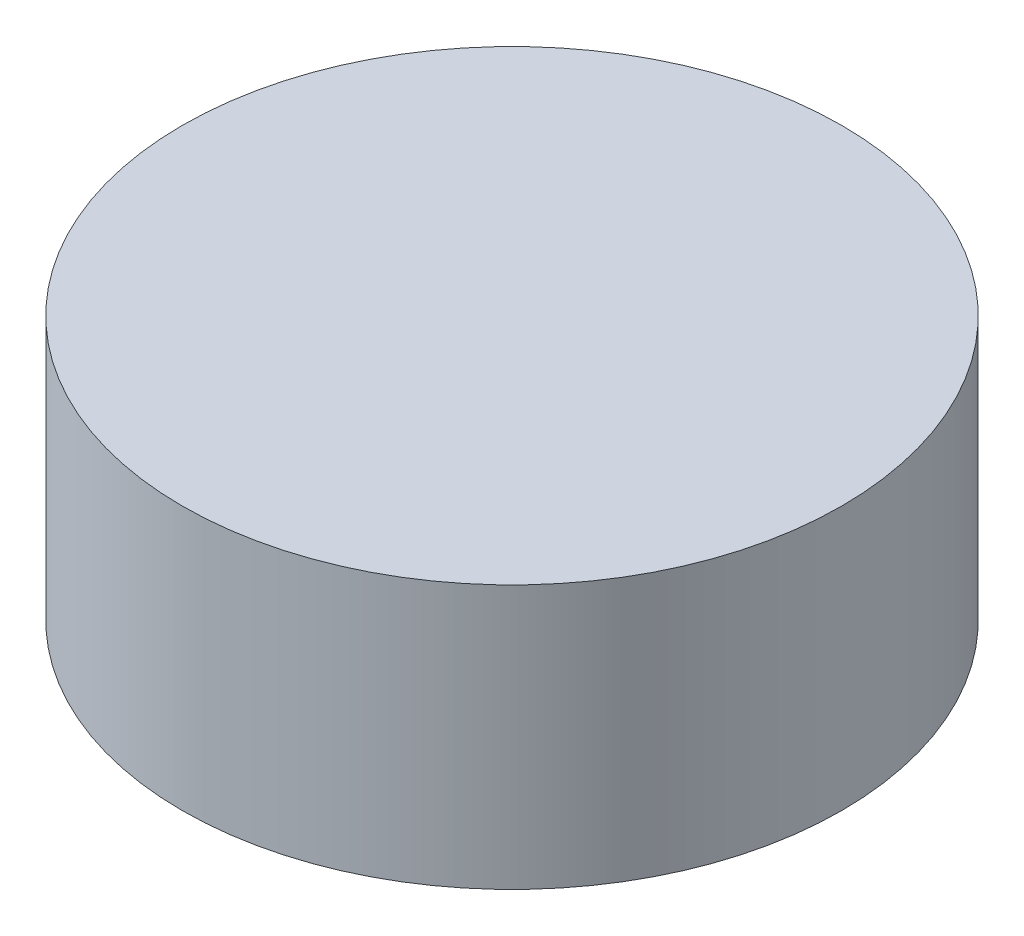
ISO-10303-21;
HEADER;
FILE_DESCRIPTION(('STEP AP214'),'2;1');
FILE_NAME('part.step','',(''),(''),'','','');
FILE_SCHEMA(('AUTOMOTIVE_DESIGN { 1 0 10303 214 1 1 1 1 }'));
ENDSEC;
DATA;
#1=APPLICATION_CONTEXT('core data for automotive mechanical design processes');
#2=APPLICATION_PROTOCOL_DEFINITION('international standard','automotive_design',2000,#1);
#3=PRODUCT_CONTEXT('',#1,'mechanical');
#4=PRODUCT('Part','Part','',(#3));
#5=PRODUCT_RELATED_PRODUCT_CATEGORY('part','',(#4));
#6=PRODUCT_DEFINITION_FORMATION('','',#4);
#7=PRODUCT_DEFINITION_CONTEXT('part definition',#1,'design');
#8=PRODUCT_DEFINITION('design','',#6,#7);
#9=PRODUCT_DEFINITION_SHAPE('','',#8);
#10=(LENGTH_UNIT() NAMED_UNIT(*) SI_UNIT(.MILLI.,.METRE.));
#11=(NAMED_UNIT(*) PLANE_ANGLE_UNIT() SI_UNIT($,.RADIAN.));
#12=(NAMED_UNIT(*) SI_UNIT($,.STERADIAN.) SOLID_ANGLE_UNIT());
#13=UNCERTAINTY_MEASURE_WITH_UNIT(LENGTH_MEASURE(1.E-05),#10,'distance_accuracy_value','');
#14=(GEOMETRIC_REPRESENTATION_CONTEXT(3) GLOBAL_UNCERTAINTY_ASSIGNED_CONTEXT((#13)) GLOBAL_UNIT_ASSIGNED_CONTEXT((#10,
#11,#12)) REPRESENTATION_CONTEXT('',''));
#15=CARTESIAN_POINT('',(0.,0.,0.));
#16=DIRECTION('',(0.,0.,1.));
#17=DIRECTION('',(1.,0.,0.));
#18=AXIS2_PLACEMENT_3D('',#15,#16,#17);
#19=CARTESIAN_POINT('',(0.,2.,0.));
#20=DIRECTION('',(0.,-1.,0.));
#21=DIRECTION('',(0.,0.,-1.));
#22=AXIS2_PLACEMENT_3D('',#19,#20,#21);
#23=CYLINDRICAL_SURFACE('',#22,2.5);
#24=CARTESIAN_POINT('',(0.,2.,0.));
#25=DIRECTION('',(0.,1.,0.));
#26=DIRECTION('',(0.,0.,1.));
#27=AXIS2_PLACEMENT_3D('',#24,#25,#26);
#28=CIRCLE('',#27,2.5);
#29=CARTESIAN_POINT('',(0.,2.,2.5));
#30=VERTEX_POINT('',#29);
#31=EDGE_CURVE('E10',#30,#30,#28,.T.);
#32=ORIENTED_EDGE('',*,*,#31,.F.);
#33=EDGE_LOOP('',(#32));
#34=FACE_BOUND('',#33,.T.);
#35=CARTESIAN_POINT('',(0.,0.,0.));
#36=DIRECTION('',(0.,1.,0.));
#37=DIRECTION('',(0.,0.,1.));
#38=AXIS2_PLACEMENT_3D('',#35,#36,#37);
#39=CIRCLE('',#38,2.5);
#40=CARTESIAN_POINT('',(0.,0.,2.5));
#41=VERTEX_POINT('',#40);
#42=EDGE_CURVE('E34',#41,#41,#39,.T.);
#43=ORIENTED_EDGE('',*,*,#42,.T.);
#44=EDGE_LOOP('',(#43));
#45=FACE_BOUND('',#44,.T.);
#46=ADVANCED_FACE('F31',(#34,#45),#23,.T.);
#47=CARTESIAN_POINT('',(0.,2.,0.));
#48=DIRECTION('',(0.,1.,0.));
#49=DIRECTION('',(0.,0.,1.));
#50=AXIS2_PLACEMENT_3D('',#47,#48,#49);
#51=PLANE('',#50);
#52=ORIENTED_EDGE('',*,*,#31,.T.);
#53=EDGE_LOOP('',(#52));
#54=FACE_BOUND('',#53,.T.);
#55=ADVANCED_FACE('F46',(#54),#51,.T.);
#56=CARTESIAN_POINT('',(0.,0.,0.));
#57=DIRECTION('',(0.,1.,0.));
#58=DIRECTION('',(0.,0.,1.));
#59=AXIS2_PLACEMENT_3D('',#56,#57,#58);
#60=PLANE('',#59);
#61=ORIENTED_EDGE('',*,*,#42,.F.);
#62=EDGE_LOOP('',(#61));
#63=FACE_BOUND('',#62,.T.);
#64=ADVANCED_FACE('F44',(#63),#60,.F.);
#65=CLOSED_SHELL('',(#46,#55,#64));
#66=MANIFOLD_SOLID_BREP('B2',#65);
#67=ADVANCED_BREP_SHAPE_REPRESENTATION('',(#18,#66),#14);
#68=SHAPE_DEFINITION_REPRESENTATION(#9,#67);
ENDSEC;
END-ISO-10303-21;
